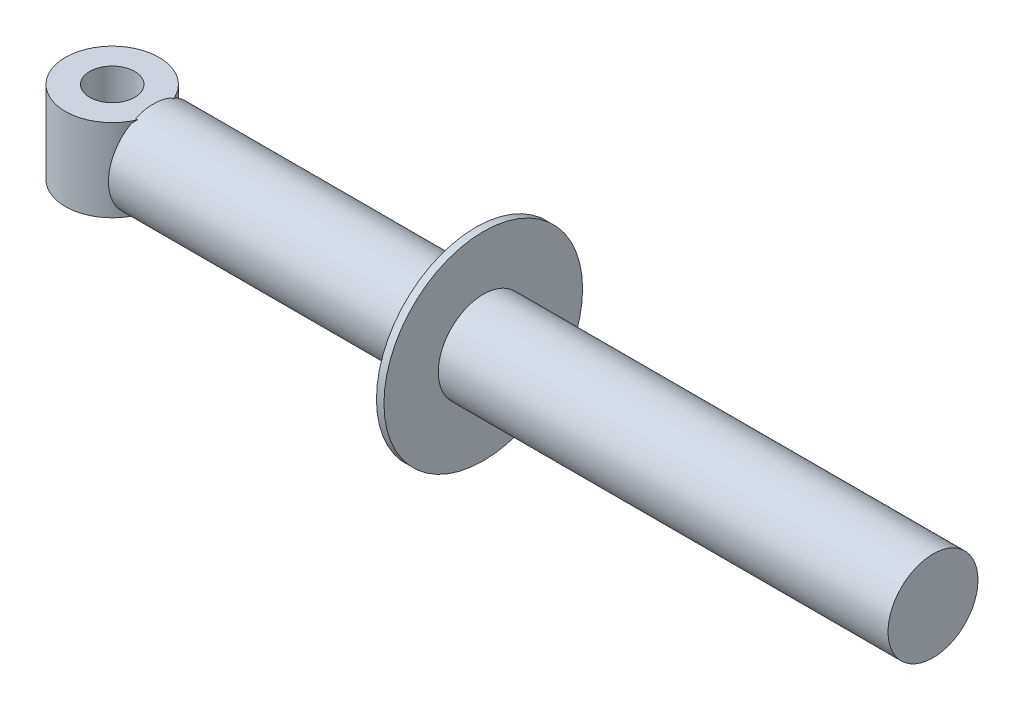
ISO-10303-21;
HEADER;
FILE_DESCRIPTION(('STEP AP214'),'2;1');
FILE_NAME('part.step','',(''),(''),'','','');
FILE_SCHEMA(('AUTOMOTIVE_DESIGN { 1 0 10303 214 1 1 1 1 }'));
ENDSEC;
DATA;
#1=APPLICATION_CONTEXT('core data for automotive mechanical design processes');
#2=APPLICATION_PROTOCOL_DEFINITION('international standard','automotive_design',2000,#1);
#3=PRODUCT_CONTEXT('',#1,'mechanical');
#4=PRODUCT('Part','Part','',(#3));
#5=PRODUCT_RELATED_PRODUCT_CATEGORY('part','',(#4));
#6=PRODUCT_DEFINITION_FORMATION('','',#4);
#7=PRODUCT_DEFINITION_CONTEXT('part definition',#1,'design');
#8=PRODUCT_DEFINITION('design','',#6,#7);
#9=PRODUCT_DEFINITION_SHAPE('','',#8);
#10=(LENGTH_UNIT() NAMED_UNIT(*) SI_UNIT(.MILLI.,.METRE.));
#11=(NAMED_UNIT(*) PLANE_ANGLE_UNIT() SI_UNIT($,.RADIAN.));
#12=(NAMED_UNIT(*) SI_UNIT($,.STERADIAN.) SOLID_ANGLE_UNIT());
#13=UNCERTAINTY_MEASURE_WITH_UNIT(LENGTH_MEASURE(1.E-05),#10,'distance_accuracy_value','');
#14=(GEOMETRIC_REPRESENTATION_CONTEXT(3) GLOBAL_UNCERTAINTY_ASSIGNED_CONTEXT((#13)) GLOBAL_UNIT_ASSIGNED_CONTEXT((#10,
#11,#12)) REPRESENTATION_CONTEXT('',''));
#15=CARTESIAN_POINT('',(0.,0.,0.));
#16=DIRECTION('',(0.,0.,1.));
#17=DIRECTION('',(1.,0.,0.));
#18=AXIS2_PLACEMENT_3D('',#15,#16,#17);
#19=CARTESIAN_POINT('',(-86.,0.,0.));
#20=DIRECTION('',(1.,0.,0.));
#21=DIRECTION('',(0.,0.,-1.));
#22=AXIS2_PLACEMENT_3D('',#19,#20,#21);
#23=CYLINDRICAL_SURFACE('',#22,12.);
#24=CARTESIAN_POINT('',(0.,0.,0.));
#25=DIRECTION('',(-1.,0.,0.));
#26=DIRECTION('',(0.,0.,1.));
#27=AXIS2_PLACEMENT_3D('',#24,#25,#26);
#28=CIRCLE('',#27,12.);
#29=CARTESIAN_POINT('',(0.,0.,12.));
#30=VERTEX_POINT('',#29);
#31=EDGE_CURVE('E117',#30,#30,#28,.T.);
#32=ORIENTED_EDGE('',*,*,#31,.T.);
#33=EDGE_LOOP('',(#32));
#34=FACE_BOUND('',#33,.T.);
#35=DIRECTION('',(1.,0.,0.));
#36=VECTOR('',#35,1.);
#37=CARTESIAN_POINT('',(-86.,-11.,-4.79583152331273));
#38=LINE('',#37,#36);
#39=CARTESIAN_POINT('',(-85.4566036193848,-11.,-4.79583152331273));
#40=VERTEX_POINT('',#39);
#41=CARTESIAN_POINT('',(-86.,-11.,-4.79583152331273));
#42=VERTEX_POINT('',#41);
#43=EDGE_CURVE('E143',#40,#42,#38,.F.);
#44=ORIENTED_EDGE('',*,*,#43,.F.);
#45=CARTESIAN_POINT('',(-86.,-10.4283268073071,-5.93717104351897));
#46=CARTESIAN_POINT('',(-85.9508507432517,-10.4801702842278,-5.84611108705566));
#47=CARTESIAN_POINT('',(-85.9025971345828,-10.531030086894,-5.75400415580452));
#48=CARTESIAN_POINT('',(-85.8080248487327,-10.6306421620264,-5.56781670686055));
#49=CARTESIAN_POINT('',(-85.7617043821797,-10.6793963850022,-5.47373814106622));
#50=CARTESIAN_POINT('',(-85.6710479901975,-10.7747562546721,-5.28355401419022));
#51=CARTESIAN_POINT('',(-85.6267120888713,-10.8213618752711,-5.18744842851072));
#52=CARTESIAN_POINT('',(-85.5400854317363,-10.9123707876851,-4.99316376109573));
#53=CARTESIAN_POINT('',(-85.4977966546669,-10.9567719497039,-4.89498279997064));
#54=CARTESIAN_POINT('',(-85.4566036193848,-11.,-4.79583152331273));
#55=B_SPLINE_CURVE_WITH_KNOTS('',3,(#45,#46,#47,#48,#49,#50,#51,#52,#53,#54),.UNSPECIFIED.,.F.,
.F.,(4,2,2,2,4),(0.,0.347205963596131,0.694083073070079,1.04096439431385,1.38817457478962),.UNSPECIFIED.);
#56=CARTESIAN_POINT('',(-86.,-10.4283268073071,-5.93717104351897));
#57=VERTEX_POINT('',#56);
#58=EDGE_CURVE('E195',#57,#40,#55,.T.);
#59=ORIENTED_EDGE('',*,*,#58,.F.);
#60=CARTESIAN_POINT('',(-86.,0.,0.));
#61=DIRECTION('',(-1.,0.,0.));
#62=DIRECTION('',(0.,0.,1.));
#63=AXIS2_PLACEMENT_3D('',#60,#61,#62);
#64=CIRCLE('',#63,12.);
#65=CARTESIAN_POINT('',(-86.,10.4283268073071,-5.93717104351897));
#66=VERTEX_POINT('',#65);
#67=EDGE_CURVE('E144',#66,#57,#64,.T.);
#68=ORIENTED_EDGE('',*,*,#67,.F.);
#69=CARTESIAN_POINT('',(-85.4566036193848,11.,-4.79583152331273));
#70=CARTESIAN_POINT('',(-85.4977966546669,10.9567719497039,-4.89498279997064));
#71=CARTESIAN_POINT('',(-85.5400854317363,10.9123707876851,-4.99316376109573));
#72=CARTESIAN_POINT('',(-85.6267120888713,10.8213618752711,-5.18744842851072));
#73=CARTESIAN_POINT('',(-85.6710479901975,10.7747562546721,-5.28355401419022));
#74=CARTESIAN_POINT('',(-85.7617043821797,10.6793963850022,-5.47373814106622));
#75=CARTESIAN_POINT('',(-85.8080248487327,10.6306421620264,-5.56781670686055));
#76=CARTESIAN_POINT('',(-85.9025971345828,10.531030086894,-5.75400415580452));
#77=CARTESIAN_POINT('',(-85.9508507432517,10.4801702842278,-5.84611108705566));
#78=CARTESIAN_POINT('',(-86.,10.4283268073071,-5.93717104351897));
#79=B_SPLINE_CURVE_WITH_KNOTS('',3,(#69,#70,#71,#72,#73,#74,#75,#76,#77,#78),.UNSPECIFIED.,.F.,
.F.,(4,2,2,2,4),(0.,0.347210180475766,0.694091501719543,1.04096861119349,1.38817457478962),.UNSPECIFIED.);
#80=CARTESIAN_POINT('',(-85.4566036193848,11.,-4.79583152331273));
#81=VERTEX_POINT('',#80);
#82=EDGE_CURVE('E98',#81,#66,#79,.T.);
#83=ORIENTED_EDGE('',*,*,#82,.F.);
#84=DIRECTION('',(1.,0.,0.));
#85=VECTOR('',#84,1.);
#86=CARTESIAN_POINT('',(-86.,11.,-4.79583152331273));
#87=LINE('',#86,#85);
#88=CARTESIAN_POINT('',(-86.,11.,-4.79583152331273));
#89=VERTEX_POINT('',#88);
#90=EDGE_CURVE('E102',#81,#89,#87,.F.);
#91=ORIENTED_EDGE('',*,*,#90,.T.);
#92=CARTESIAN_POINT('',(-86.,11.,4.79583152331272));
#93=VERTEX_POINT('',#92);
#94=EDGE_CURVE('E108',#93,#89,#64,.T.);
#95=ORIENTED_EDGE('',*,*,#94,.F.);
#96=DIRECTION('',(1.,0.,0.));
#97=VECTOR('',#96,1.);
#98=CARTESIAN_POINT('',(-86.,11.,4.79583152331272));
#99=LINE('',#98,#97);
#100=CARTESIAN_POINT('',(-85.4566036193848,11.,4.79583152331272));
#101=VERTEX_POINT('',#100);
#102=EDGE_CURVE('E101',#93,#101,#99,.T.);
#103=ORIENTED_EDGE('',*,*,#102,.T.);
#104=CARTESIAN_POINT('',(-86.,10.4283268073071,5.93717104351897));
#105=CARTESIAN_POINT('',(-85.9508507432517,10.4801702842278,5.84611108705566));
#106=CARTESIAN_POINT('',(-85.9025971345828,10.531030086894,5.75400415580451));
#107=CARTESIAN_POINT('',(-85.8080248487327,10.6306421620264,5.56781670686055));
#108=CARTESIAN_POINT('',(-85.7617043821797,10.6793963850022,5.47373814106621));
#109=CARTESIAN_POINT('',(-85.6710479901975,10.7747562546721,5.28355401419021));
#110=CARTESIAN_POINT('',(-85.6267120888713,10.8213618752711,5.1874484285107));
#111=CARTESIAN_POINT('',(-85.5400854317363,10.9123707876851,4.99316376109571));
#112=CARTESIAN_POINT('',(-85.4977966546669,10.9567719497039,4.89498279997062));
#113=CARTESIAN_POINT('',(-85.4566036193848,11.,4.79583152331272));
#114=B_SPLINE_CURVE_WITH_KNOTS('',3,(#104,#105,#106,#107,#108,#109,#110,#111,#112,#113),
.UNSPECIFIED.,.F.,.F.,(4,2,2,2,4),(0.,0.347205963596149,0.694083073070094,1.04096439431388,
1.38817457478964),.UNSPECIFIED.);
#115=CARTESIAN_POINT('',(-86.,10.4283268073071,5.93717104351897));
#116=VERTEX_POINT('',#115);
#117=EDGE_CURVE('E88',#116,#101,#114,.T.);
#118=ORIENTED_EDGE('',*,*,#117,.F.);
#119=CARTESIAN_POINT('',(-86.,-10.4283268073071,5.93717104351897));
#120=VERTEX_POINT('',#119);
#121=EDGE_CURVE('E109',#120,#116,#64,.T.);
#122=ORIENTED_EDGE('',*,*,#121,.F.);
#123=CARTESIAN_POINT('',(-85.4566036193848,-11.,4.79583152331272));
#124=CARTESIAN_POINT('',(-85.4977966546669,-10.9567719497039,4.89498279997062));
#125=CARTESIAN_POINT('',(-85.5400854317363,-10.9123707876851,4.99316376109571));
#126=CARTESIAN_POINT('',(-85.6267120888713,-10.8213618752711,5.18744842851071));
#127=CARTESIAN_POINT('',(-85.6710479901975,-10.7747562546721,5.28355401419021));
#128=CARTESIAN_POINT('',(-85.7617043821797,-10.6793963850022,5.47373814106622));
#129=CARTESIAN_POINT('',(-85.8080248487327,-10.6306421620264,5.56781670686055));
#130=CARTESIAN_POINT('',(-85.9025971345828,-10.531030086894,5.75400415580451));
#131=CARTESIAN_POINT('',(-85.9508507432517,-10.4801702842278,5.84611108705566));
#132=CARTESIAN_POINT('',(-86.,-10.4283268073071,5.93717104351897));
#133=B_SPLINE_CURVE_WITH_KNOTS('',3,(#123,#124,#125,#126,#127,#128,#129,#130,#131,#132),
.UNSPECIFIED.,.F.,.F.,(4,2,2,2,4),(0.,0.34721018047577,0.694091501719547,1.04096861119351,
1.38817457478964),.UNSPECIFIED.);
#134=CARTESIAN_POINT('',(-85.4566036193848,-11.,4.79583152331272));
#135=VERTEX_POINT('',#134);
#136=EDGE_CURVE('E52',#135,#120,#133,.T.);
#137=ORIENTED_EDGE('',*,*,#136,.F.);
#138=DIRECTION('',(1.,0.,0.));
#139=VECTOR('',#138,1.);
#140=CARTESIAN_POINT('',(-86.,-11.,4.79583152331272));
#141=LINE('',#140,#139);
#142=CARTESIAN_POINT('',(-86.,-11.,4.79583152331272));
#143=VERTEX_POINT('',#142);
#144=EDGE_CURVE('E113',#143,#135,#141,.T.);
#145=ORIENTED_EDGE('',*,*,#144,.F.);
#146=EDGE_CURVE('E111',#42,#143,#64,.T.);
#147=ORIENTED_EDGE('',*,*,#146,.F.);
#148=EDGE_LOOP('',(#44,#59,#68,#83,#91,#95,#103,#118,#122,#137,#145,#147));
#149=FACE_BOUND('',#148,.T.);
#150=ADVANCED_FACE('F37',(#34,#149),#23,.T.);
#151=CARTESIAN_POINT('',(-86.,0.,0.));
#152=DIRECTION('',(-1.,0.,0.));
#153=DIRECTION('',(0.,0.,1.));
#154=AXIS2_PLACEMENT_3D('',#151,#152,#153);
#155=PLANE('',#154);
#156=ORIENTED_EDGE('',*,*,#146,.T.);
#157=DIRECTION('',(0.,0.,-1.));
#158=VECTOR('',#157,1.);
#159=CARTESIAN_POINT('',(-86.,-11.,0.));
#160=LINE('',#159,#158);
#161=EDGE_CURVE('E45',#143,#42,#160,.T.);
#162=ORIENTED_EDGE('',*,*,#161,.T.);
#163=EDGE_LOOP('',(#156,#162));
#164=FACE_BOUND('',#163,.T.);
#165=ADVANCED_FACE('F139',(#164),#155,.T.);
#166=ORIENTED_EDGE('',*,*,#67,.T.);
#167=DIRECTION('',(0.,-1.,0.));
#168=VECTOR('',#167,1.);
#169=CARTESIAN_POINT('',(-86.,11.,-5.93717104351897));
#170=LINE('',#169,#168);
#171=EDGE_CURVE('E133',#57,#66,#170,.F.);
#172=ORIENTED_EDGE('',*,*,#171,.T.);
#173=EDGE_LOOP('',(#166,#172));
#174=FACE_BOUND('',#173,.T.);
#175=ADVANCED_FACE('F167',(#174),#155,.T.);
#176=ORIENTED_EDGE('',*,*,#121,.T.);
#177=DIRECTION('',(0.,-1.,0.));
#178=VECTOR('',#177,1.);
#179=CARTESIAN_POINT('',(-86.,11.,5.93717104351897));
#180=LINE('',#179,#178);
#181=EDGE_CURVE('E93',#116,#120,#180,.T.);
#182=ORIENTED_EDGE('',*,*,#181,.T.);
#183=EDGE_LOOP('',(#176,#182));
#184=FACE_BOUND('',#183,.T.);
#185=ADVANCED_FACE('F153',(#184),#155,.T.);
#186=CARTESIAN_POINT('',(0.,0.,0.));
#187=DIRECTION('',(-1.,0.,0.));
#188=DIRECTION('',(0.,0.,1.));
#189=AXIS2_PLACEMENT_3D('',#186,#187,#188);
#190=PLANE('',#189);
#191=ORIENTED_EDGE('',*,*,#31,.F.);
#192=EDGE_LOOP('',(#191));
#193=FACE_BOUND('',#192,.T.);
#194=CARTESIAN_POINT('',(0.,0.,0.));
#195=DIRECTION('',(1.,0.,0.));
#196=DIRECTION('',(0.,0.,-1.));
#197=AXIS2_PLACEMENT_3D('',#194,#195,#196);
#198=CIRCLE('',#197,26.5);
#199=CARTESIAN_POINT('',(0.,0.,-26.5));
#200=VERTEX_POINT('',#199);
#201=EDGE_CURVE('E120',#200,#200,#198,.T.);
#202=ORIENTED_EDGE('',*,*,#201,.F.);
#203=EDGE_LOOP('',(#202));
#204=FACE_BOUND('',#203,.T.);
#205=ADVANCED_FACE('F39',(#193,#204),#190,.T.);
#206=CARTESIAN_POINT('',(122.,0.,0.));
#207=DIRECTION('',(1.,0.,0.));
#208=DIRECTION('',(0.,0.,-1.));
#209=AXIS2_PLACEMENT_3D('',#206,#207,#208);
#210=CYLINDRICAL_SURFACE('',#209,26.5);
#211=ORIENTED_EDGE('',*,*,#201,.T.);
#212=EDGE_LOOP('',(#211));
#213=FACE_BOUND('',#212,.T.);
#214=CARTESIAN_POINT('',(2.,0.,0.));
#215=DIRECTION('',(1.,0.,0.));
#216=DIRECTION('',(0.,0.,-1.));
#217=AXIS2_PLACEMENT_3D('',#214,#215,#216);
#218=CIRCLE('',#217,26.5);
#219=CARTESIAN_POINT('',(2.,0.,-26.5));
#220=VERTEX_POINT('',#219);
#221=EDGE_CURVE('E127',#220,#220,#218,.T.);
#222=ORIENTED_EDGE('',*,*,#221,.F.);
#223=EDGE_LOOP('',(#222));
#224=FACE_BOUND('',#223,.T.);
#225=ADVANCED_FACE('F240',(#213,#224),#210,.T.);
#226=CARTESIAN_POINT('',(2.,0.,-26.5));
#227=DIRECTION('',(1.,0.,0.));
#228=DIRECTION('',(0.,0.,-1.));
#229=AXIS2_PLACEMENT_3D('',#226,#227,#228);
#230=PLANE('',#229);
#231=ORIENTED_EDGE('',*,*,#221,.T.);
#232=EDGE_LOOP('',(#231));
#233=FACE_BOUND('',#232,.T.);
#234=CARTESIAN_POINT('',(2.,0.,0.));
#235=DIRECTION('',(1.,0.,0.));
#236=DIRECTION('',(0.,0.,-1.));
#237=AXIS2_PLACEMENT_3D('',#234,#235,#236);
#238=CIRCLE('',#237,12.);
#239=CARTESIAN_POINT('',(2.,0.,-12.));
#240=VERTEX_POINT('',#239);
#241=EDGE_CURVE('E124',#240,#240,#238,.T.);
#242=ORIENTED_EDGE('',*,*,#241,.F.);
#243=EDGE_LOOP('',(#242));
#244=FACE_BOUND('',#243,.T.);
#245=ADVANCED_FACE('F248',(#233,#244),#230,.T.);
#246=CARTESIAN_POINT('',(122.,0.,0.));
#247=DIRECTION('',(1.,0.,0.));
#248=DIRECTION('',(0.,0.,-1.));
#249=AXIS2_PLACEMENT_3D('',#246,#247,#248);
#250=CYLINDRICAL_SURFACE('',#249,12.);
#251=ORIENTED_EDGE('',*,*,#241,.T.);
#252=EDGE_LOOP('',(#251));
#253=FACE_BOUND('',#252,.T.);
#254=CARTESIAN_POINT('',(122.,0.,0.));
#255=DIRECTION('',(1.,0.,0.));
#256=DIRECTION('',(0.,0.,-1.));
#257=AXIS2_PLACEMENT_3D('',#254,#255,#256);
#258=CIRCLE('',#257,12.);
#259=CARTESIAN_POINT('',(122.,0.,-12.));
#260=VERTEX_POINT('',#259);
#261=EDGE_CURVE('E121',#260,#260,#258,.T.);
#262=ORIENTED_EDGE('',*,*,#261,.F.);
#263=EDGE_LOOP('',(#262));
#264=FACE_BOUND('',#263,.T.);
#265=ADVANCED_FACE('F161',(#253,#264),#250,.T.);
#266=CARTESIAN_POINT('',(122.,0.,-12.));
#267=DIRECTION('',(1.,0.,0.));
#268=DIRECTION('',(0.,0.,-1.));
#269=AXIS2_PLACEMENT_3D('',#266,#267,#268);
#270=PLANE('',#269);
#271=ORIENTED_EDGE('',*,*,#261,.T.);
#272=EDGE_LOOP('',(#271));
#273=FACE_BOUND('',#272,.T.);
#274=ADVANCED_FACE('F151',(#273),#270,.T.);
#275=DIRECTION('',(0.,0.,-1.));
#276=VECTOR('',#275,1.);
#277=CARTESIAN_POINT('',(-86.,11.,0.));
#278=LINE('',#277,#276);
#279=EDGE_CURVE('E11',#93,#89,#278,.T.);
#280=ORIENTED_EDGE('',*,*,#279,.F.);
#281=ORIENTED_EDGE('',*,*,#94,.T.);
#282=EDGE_LOOP('',(#280,#281));
#283=FACE_BOUND('',#282,.T.);
#284=ADVANCED_FACE('F149',(#283),#155,.T.);
#285=CARTESIAN_POINT('',(-97.,11.,0.));
#286=DIRECTION('',(0.,1.,0.));
#287=DIRECTION('',(0.,0.,1.));
#288=AXIS2_PLACEMENT_3D('',#285,#286,#287);
#289=PLANE('',#288);
#290=CARTESIAN_POINT('',(-97.,11.,0.));
#291=DIRECTION('',(0.,1.,0.));
#292=DIRECTION('',(0.,0.,1.));
#293=AXIS2_PLACEMENT_3D('',#290,#291,#292);
#294=CIRCLE('',#293,6.);
#295=CARTESIAN_POINT('',(-97.,11.,6.));
#296=VERTEX_POINT('',#295);
#297=EDGE_CURVE('E218',#296,#296,#294,.T.);
#298=ORIENTED_EDGE('',*,*,#297,.F.);
#299=EDGE_LOOP('',(#298));
#300=FACE_BOUND('',#299,.T.);
#301=ORIENTED_EDGE('',*,*,#102,.F.);
#302=ORIENTED_EDGE('',*,*,#279,.T.);
#303=ORIENTED_EDGE('',*,*,#90,.F.);
#304=CARTESIAN_POINT('',(-97.,11.,0.));
#305=DIRECTION('',(0.,1.,0.));
#306=DIRECTION('',(0.,0.,1.));
#307=AXIS2_PLACEMENT_3D('',#304,#305,#306);
#308=CIRCLE('',#307,12.5);
#309=EDGE_CURVE('E91',#81,#101,#308,.T.);
#310=ORIENTED_EDGE('',*,*,#309,.T.);
#311=EDGE_LOOP('',(#301,#302,#303,#310));
#312=FACE_BOUND('',#311,.T.);
#313=ADVANCED_FACE('F100',(#300,#312),#289,.T.);
#314=CARTESIAN_POINT('',(-97.,-11.,0.));
#315=DIRECTION('',(0.,1.,0.));
#316=DIRECTION('',(0.,0.,1.));
#317=AXIS2_PLACEMENT_3D('',#314,#315,#316);
#318=PLANE('',#317);
#319=CARTESIAN_POINT('',(-97.,-11.,0.));
#320=DIRECTION('',(0.,1.,0.));
#321=DIRECTION('',(0.,0.,1.));
#322=AXIS2_PLACEMENT_3D('',#319,#320,#321);
#323=CIRCLE('',#322,6.);
#324=CARTESIAN_POINT('',(-97.,-11.,6.));
#325=VERTEX_POINT('',#324);
#326=EDGE_CURVE('E221',#325,#325,#323,.T.);
#327=ORIENTED_EDGE('',*,*,#326,.T.);
#328=EDGE_LOOP('',(#327));
#329=FACE_BOUND('',#328,.T.);
#330=ORIENTED_EDGE('',*,*,#161,.F.);
#331=ORIENTED_EDGE('',*,*,#144,.T.);
#332=CARTESIAN_POINT('',(-97.,-11.,0.));
#333=DIRECTION('',(0.,1.,0.));
#334=DIRECTION('',(0.,0.,1.));
#335=AXIS2_PLACEMENT_3D('',#332,#333,#334);
#336=CIRCLE('',#335,12.5);
#337=EDGE_CURVE('E103',#40,#135,#336,.T.);
#338=ORIENTED_EDGE('',*,*,#337,.F.);
#339=ORIENTED_EDGE('',*,*,#43,.T.);
#340=EDGE_LOOP('',(#330,#331,#338,#339));
#341=FACE_BOUND('',#340,.T.);
#342=ADVANCED_FACE('F158',(#329,#341),#318,.F.);
#343=CARTESIAN_POINT('',(-97.,11.,0.));
#344=DIRECTION('',(0.,-1.,0.));
#345=DIRECTION('',(0.,0.,-1.));
#346=AXIS2_PLACEMENT_3D('',#343,#344,#345);
#347=CYLINDRICAL_SURFACE('',#346,12.5);
#348=ORIENTED_EDGE('',*,*,#171,.F.);
#349=ORIENTED_EDGE('',*,*,#58,.T.);
#350=ORIENTED_EDGE('',*,*,#337,.T.);
#351=ORIENTED_EDGE('',*,*,#136,.T.);
#352=ORIENTED_EDGE('',*,*,#181,.F.);
#353=ORIENTED_EDGE('',*,*,#117,.T.);
#354=ORIENTED_EDGE('',*,*,#309,.F.);
#355=ORIENTED_EDGE('',*,*,#82,.T.);
#356=EDGE_LOOP('',(#348,#349,#350,#351,#352,#353,#354,#355));
#357=FACE_BOUND('',#356,.T.);
#358=ADVANCED_FACE('F90',(#357),#347,.T.);
#359=CARTESIAN_POINT('',(-97.,11.,0.));
#360=DIRECTION('',(0.,-1.,0.));
#361=DIRECTION('',(0.,0.,-1.));
#362=AXIS2_PLACEMENT_3D('',#359,#360,#361);
#363=CYLINDRICAL_SURFACE('',#362,6.);
#364=ORIENTED_EDGE('',*,*,#297,.T.);
#365=EDGE_LOOP('',(#364));
#366=FACE_BOUND('',#365,.T.);
#367=ORIENTED_EDGE('',*,*,#326,.F.);
#368=EDGE_LOOP('',(#367));
#369=FACE_BOUND('',#368,.T.);
#370=ADVANCED_FACE('F204',(#366,#369),#363,.F.);
#371=CLOSED_SHELL('',(#150,#165,#175,#185,#205,#225,#245,#265,#274,#284,#313,#342,#358,#370));
#372=MANIFOLD_SOLID_BREP('B2',#371);
#373=ADVANCED_BREP_SHAPE_REPRESENTATION('',(#18,#372),#14);
#374=SHAPE_DEFINITION_REPRESENTATION(#9,#373);
ENDSEC;
END-ISO-10303-21;
